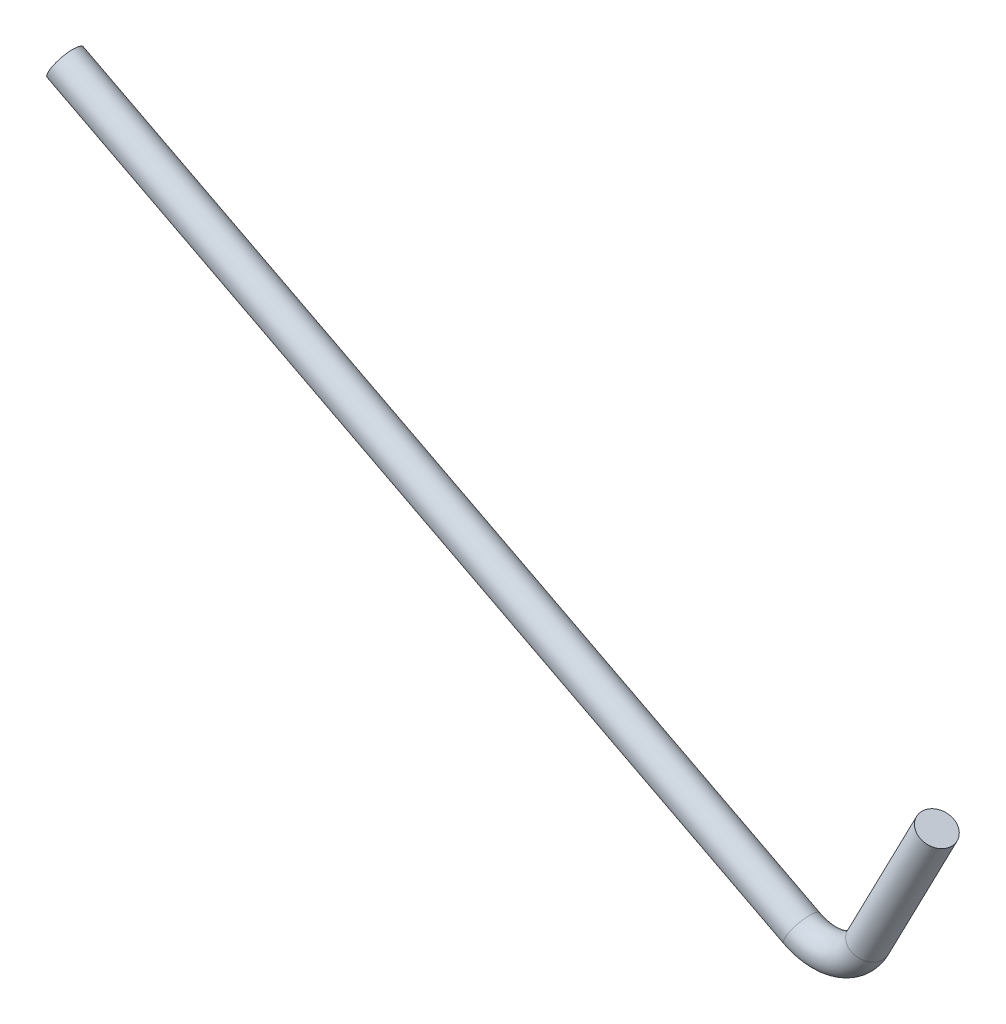
ISO-10303-21;
HEADER;
FILE_DESCRIPTION(('STEP AP214'),'2;1');
FILE_NAME('part.step','',(''),(''),'','','');
FILE_SCHEMA(('AUTOMOTIVE_DESIGN { 1 0 10303 214 1 1 1 1 }'));
ENDSEC;
DATA;
#1=APPLICATION_CONTEXT('core data for automotive mechanical design processes');
#2=APPLICATION_PROTOCOL_DEFINITION('international standard','automotive_design',2000,#1);
#3=PRODUCT_CONTEXT('',#1,'mechanical');
#4=PRODUCT('Part','Part','',(#3));
#5=PRODUCT_RELATED_PRODUCT_CATEGORY('part','',(#4));
#6=PRODUCT_DEFINITION_FORMATION('','',#4);
#7=PRODUCT_DEFINITION_CONTEXT('part definition',#1,'design');
#8=PRODUCT_DEFINITION('design','',#6,#7);
#9=PRODUCT_DEFINITION_SHAPE('','',#8);
#10=(LENGTH_UNIT() NAMED_UNIT(*) SI_UNIT(.MILLI.,.METRE.));
#11=(NAMED_UNIT(*) PLANE_ANGLE_UNIT() SI_UNIT($,.RADIAN.));
#12=(NAMED_UNIT(*) SI_UNIT($,.STERADIAN.) SOLID_ANGLE_UNIT());
#13=UNCERTAINTY_MEASURE_WITH_UNIT(LENGTH_MEASURE(1.E-05),#10,'distance_accuracy_value','');
#14=(GEOMETRIC_REPRESENTATION_CONTEXT(3) GLOBAL_UNCERTAINTY_ASSIGNED_CONTEXT((#13)) GLOBAL_UNIT_ASSIGNED_CONTEXT((#10,
#11,#12)) REPRESENTATION_CONTEXT('',''));
#15=CARTESIAN_POINT('',(0.,0.,0.));
#16=DIRECTION('',(0.,0.,1.));
#17=DIRECTION('',(1.,0.,0.));
#18=AXIS2_PLACEMENT_3D('',#15,#16,#17);
#19=CARTESIAN_POINT('',(115.739263079083,423.171876570599,0.));
#20=DIRECTION('',(-0.887813405294603,0.460203604265765,0.));
#21=DIRECTION('',(0.,0.,-1.));
#22=AXIS2_PLACEMENT_3D('',#19,#20,#21);
#23=CYLINDRICAL_SURFACE('',#22,15.);
#24=CARTESIAN_POINT('',(-723.047011876708,857.961962686972,0.));
#25=DIRECTION('',(0.887813405294603,-0.460203604265765,0.));
#26=DIRECTION('',(0.,0.,1.));
#27=AXIS2_PLACEMENT_3D('',#24,#25,#26);
#28=CIRCLE('',#27,15.);
#29=CARTESIAN_POINT('',(-723.047011876708,857.961962686972,15.));
#30=VERTEX_POINT('',#29);
#31=EDGE_CURVE('E80',#30,#30,#28,.T.);
#32=ORIENTED_EDGE('',*,*,#31,.T.);
#33=EDGE_LOOP('',(#32));
#34=FACE_BOUND('',#33,.T.);
#35=CARTESIAN_POINT('',(-64.2894651481127,516.490888321774,0.));
#36=DIRECTION('',(0.887813405294603,-0.460203604265765,0.));
#37=DIRECTION('',(0.,0.,1.));
#38=AXIS2_PLACEMENT_3D('',#35,#36,#37);
#39=CIRCLE('',#38,15.);
#40=CARTESIAN_POINT('',(-64.2894651481127,516.490888321774,15.));
#41=VERTEX_POINT('',#40);
#42=EDGE_CURVE('E75',#41,#41,#39,.T.);
#43=ORIENTED_EDGE('',*,*,#42,.F.);
#44=EDGE_LOOP('',(#43));
#45=FACE_BOUND('',#44,.T.);
#46=ADVANCED_FACE('F67',(#34,#45),#23,.T.);
#47=CARTESIAN_POINT('',(-44.027740350935,555.579306410164,0.));
#48=DIRECTION('',(0.,0.,1.));
#49=DIRECTION('',(1.,0.,0.));
#50=AXIS2_PLACEMENT_3D('',#47,#48,#49);
#51=TOROIDAL_SURFACE('',#50,44.027740350935,15.);
#52=ORIENTED_EDGE('',*,*,#42,.T.);
#53=EDGE_LOOP('',(#52));
#54=FACE_BOUND('',#53,.T.);
#55=CARTESIAN_POINT('',(-4.93932226254479,535.317581612987,0.));
#56=DIRECTION('',(0.460203604265762,0.887813405294604,0.));
#57=DIRECTION('',(0.,0.,1.));
#58=AXIS2_PLACEMENT_3D('',#55,#56,#57);
#59=CIRCLE('',#58,15.);
#60=CARTESIAN_POINT('',(-4.93932226254479,535.317581612987,15.));
#61=VERTEX_POINT('',#60);
#62=EDGE_CURVE('E12',#61,#61,#59,.T.);
#63=ORIENTED_EDGE('',*,*,#62,.F.);
#64=EDGE_LOOP('',(#63));
#65=FACE_BOUND('',#64,.T.);
#66=ADVANCED_FACE('F104',(#54,#65),#51,.T.);
#67=CARTESIAN_POINT('',(56.5526466026939,653.946366286716,0.));
#68=DIRECTION('',(-0.460203604265762,-0.887813405294605,0.));
#69=DIRECTION('',(0.,0.,-1.));
#70=AXIS2_PLACEMENT_3D('',#67,#68,#69);
#71=CYLINDRICAL_SURFACE('',#70,15.);
#72=ORIENTED_EDGE('',*,*,#62,.T.);
#73=EDGE_LOOP('',(#72));
#74=FACE_BOUND('',#73,.T.);
#75=CARTESIAN_POINT('',(56.5526466026939,653.946366286716,0.));
#76=DIRECTION('',(0.460203604265762,0.887813405294605,0.));
#77=DIRECTION('',(0.,0.,1.));
#78=AXIS2_PLACEMENT_3D('',#75,#76,#77);
#79=CIRCLE('',#78,15.);
#80=CARTESIAN_POINT('',(56.5526466026939,653.946366286716,15.));
#81=VERTEX_POINT('',#80);
#82=EDGE_CURVE('E87',#81,#81,#79,.T.);
#83=ORIENTED_EDGE('',*,*,#82,.F.);
#84=EDGE_LOOP('',(#83));
#85=FACE_BOUND('',#84,.T.);
#86=ADVANCED_FACE('F101',(#74,#85),#71,.T.);
#87=CARTESIAN_POINT('',(56.5526466026939,653.946366286716,0.));
#88=DIRECTION('',(0.460203604265762,0.887813405294605,0.));
#89=DIRECTION('',(0.,0.,1.));
#90=AXIS2_PLACEMENT_3D('',#87,#88,#89);
#91=PLANE('',#90);
#92=ORIENTED_EDGE('',*,*,#82,.T.);
#93=EDGE_LOOP('',(#92));
#94=FACE_BOUND('',#93,.T.);
#95=ADVANCED_FACE('F97',(#94),#91,.T.);
#96=CARTESIAN_POINT('',(-723.047011876708,857.961962686972,0.));
#97=DIRECTION('',(0.887813405294603,-0.460203604265765,0.));
#98=DIRECTION('',(0.,0.,1.));
#99=AXIS2_PLACEMENT_3D('',#96,#97,#98);
#100=PLANE('',#99);
#101=ORIENTED_EDGE('',*,*,#31,.F.);
#102=EDGE_LOOP('',(#101));
#103=FACE_BOUND('',#102,.T.);
#104=ADVANCED_FACE('F69',(#103),#100,.F.);
#105=CLOSED_SHELL('',(#46,#66,#86,#95,#104));
#106=MANIFOLD_SOLID_BREP('B2',#105);
#107=ADVANCED_BREP_SHAPE_REPRESENTATION('',(#18,#106),#14);
#108=SHAPE_DEFINITION_REPRESENTATION(#9,#107);
ENDSEC;
END-ISO-10303-21;
